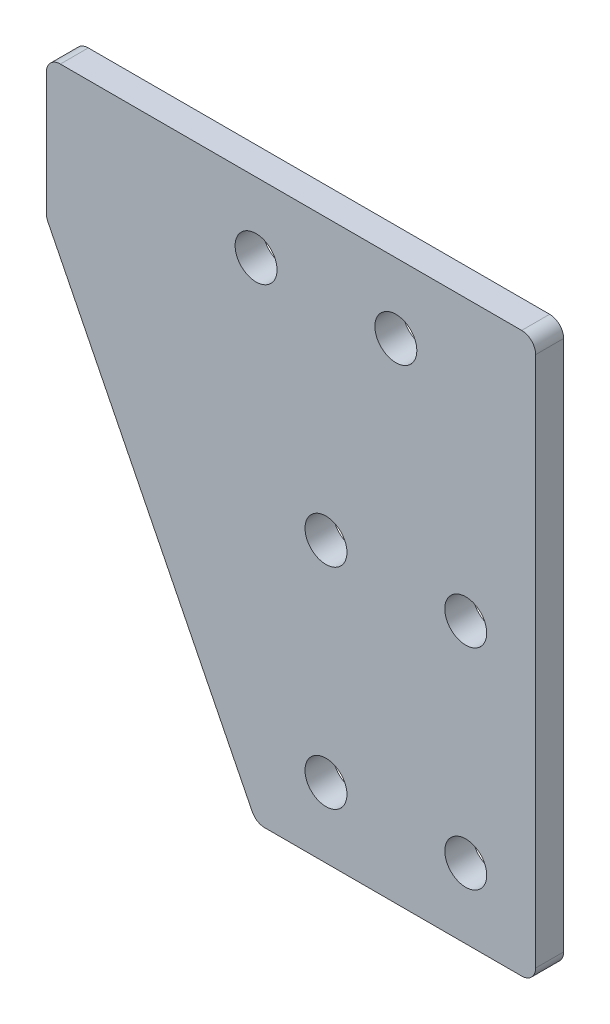
ISO-10303-21;
HEADER;
FILE_DESCRIPTION(('STEP AP214'),'2;1');
FILE_NAME('part.step','',(''),(''),'','','');
FILE_SCHEMA(('AUTOMOTIVE_DESIGN { 1 0 10303 214 1 1 1 1 }'));
ENDSEC;
DATA;
#1=APPLICATION_CONTEXT('core data for automotive mechanical design processes');
#2=APPLICATION_PROTOCOL_DEFINITION('international standard','automotive_design',2000,#1);
#3=PRODUCT_CONTEXT('',#1,'mechanical');
#4=PRODUCT('Part','Part','',(#3));
#5=PRODUCT_RELATED_PRODUCT_CATEGORY('part','',(#4));
#6=PRODUCT_DEFINITION_FORMATION('','',#4);
#7=PRODUCT_DEFINITION_CONTEXT('part definition',#1,'design');
#8=PRODUCT_DEFINITION('design','',#6,#7);
#9=PRODUCT_DEFINITION_SHAPE('','',#8);
#10=(LENGTH_UNIT() NAMED_UNIT(*) SI_UNIT(.MILLI.,.METRE.));
#11=(NAMED_UNIT(*) PLANE_ANGLE_UNIT() SI_UNIT($,.RADIAN.));
#12=(NAMED_UNIT(*) SI_UNIT($,.STERADIAN.) SOLID_ANGLE_UNIT());
#13=UNCERTAINTY_MEASURE_WITH_UNIT(LENGTH_MEASURE(1.E-05),#10,'distance_accuracy_value','');
#14=(GEOMETRIC_REPRESENTATION_CONTEXT(3) GLOBAL_UNCERTAINTY_ASSIGNED_CONTEXT((#13)) GLOBAL_UNIT_ASSIGNED_CONTEXT((#10,
#11,#12)) REPRESENTATION_CONTEXT('',''));
#15=CARTESIAN_POINT('',(0.,0.,0.));
#16=DIRECTION('',(0.,0.,1.));
#17=DIRECTION('',(1.,0.,0.));
#18=AXIS2_PLACEMENT_3D('',#15,#16,#17);
#19=CARTESIAN_POINT('',(0.,0.,2.));
#20=DIRECTION('',(0.,0.,-1.));
#21=DIRECTION('',(-1.,0.,0.));
#22=AXIS2_PLACEMENT_3D('',#19,#20,#21);
#23=PLANE('',#22);
#24=DIRECTION('',(1.,0.,0.));
#25=VECTOR('',#24,1.);
#26=CARTESIAN_POINT('',(5.,-35.,2.));
#27=LINE('',#26,#25);
#28=CARTESIAN_POINT('',(-14.3819660112501,-35.,2.));
#29=VERTEX_POINT('',#28);
#30=CARTESIAN_POINT('',(4.,-35.,2.));
#31=VERTEX_POINT('',#30);
#32=EDGE_CURVE('E201',#29,#31,#27,.T.);
#33=ORIENTED_EDGE('',*,*,#32,.T.);
#34=CARTESIAN_POINT('',(4.,-34.,2.));
#35=DIRECTION('',(0.,0.,-1.));
#36=DIRECTION('',(-1.,0.,0.));
#37=AXIS2_PLACEMENT_3D('',#34,#35,#36);
#38=CIRCLE('',#37,1.);
#39=CARTESIAN_POINT('',(5.,-34.,2.));
#40=VERTEX_POINT('',#39);
#41=EDGE_CURVE('E173',#31,#40,#38,.F.);
#42=ORIENTED_EDGE('',*,*,#41,.T.);
#43=DIRECTION('',(0.,1.,0.));
#44=VECTOR('',#43,1.);
#45=CARTESIAN_POINT('',(4.99999999999999,5.,2.));
#46=LINE('',#45,#44);
#47=CARTESIAN_POINT('',(4.99999999999999,4.,2.));
#48=VERTEX_POINT('',#47);
#49=EDGE_CURVE('E136',#40,#48,#46,.T.);
#50=ORIENTED_EDGE('',*,*,#49,.T.);
#51=CARTESIAN_POINT('',(3.99999999999999,4.,2.));
#52=DIRECTION('',(0.,0.,-1.));
#53=DIRECTION('',(-1.,0.,0.));
#54=AXIS2_PLACEMENT_3D('',#51,#52,#53);
#55=CIRCLE('',#54,1.);
#56=CARTESIAN_POINT('',(3.99999999999999,5.,2.));
#57=VERTEX_POINT('',#56);
#58=EDGE_CURVE('E169',#48,#57,#55,.F.);
#59=ORIENTED_EDGE('',*,*,#58,.T.);
#60=DIRECTION('',(-1.,0.,0.));
#61=VECTOR('',#60,1.);
#62=CARTESIAN_POINT('',(-30.,5.,2.));
#63=LINE('',#62,#61);
#64=CARTESIAN_POINT('',(-29.,5.,2.));
#65=VERTEX_POINT('',#64);
#66=EDGE_CURVE('E210',#57,#65,#63,.T.);
#67=ORIENTED_EDGE('',*,*,#66,.T.);
#68=CARTESIAN_POINT('',(-29.,4.,2.));
#69=DIRECTION('',(0.,0.,-1.));
#70=DIRECTION('',(-1.,0.,0.));
#71=AXIS2_PLACEMENT_3D('',#68,#69,#70);
#72=CIRCLE('',#71,1.);
#73=CARTESIAN_POINT('',(-30.,4.,2.));
#74=VERTEX_POINT('',#73);
#75=EDGE_CURVE('E59',#65,#74,#72,.F.);
#76=ORIENTED_EDGE('',*,*,#75,.T.);
#77=DIRECTION('',(0.,-1.,0.));
#78=VECTOR('',#77,1.);
#79=CARTESIAN_POINT('',(-30.,-5.,2.));
#80=LINE('',#79,#78);
#81=CARTESIAN_POINT('',(-30.,-4.76393202250021,2.));
#82=VERTEX_POINT('',#81);
#83=EDGE_CURVE('E156',#74,#82,#80,.T.);
#84=ORIENTED_EDGE('',*,*,#83,.T.);
#85=CARTESIAN_POINT('',(-29.,-4.76393202250021,2.));
#86=DIRECTION('',(0.,0.,-1.));
#87=DIRECTION('',(-1.,0.,0.));
#88=AXIS2_PLACEMENT_3D('',#85,#86,#87);
#89=CIRCLE('',#88,1.);
#90=CARTESIAN_POINT('',(-29.8944271909999,-5.21114561800016,2.));
#91=VERTEX_POINT('',#90);
#92=EDGE_CURVE('E167',#82,#91,#89,.F.);
#93=ORIENTED_EDGE('',*,*,#92,.T.);
#94=DIRECTION('',(0.447213595499958,-0.894427190999916,0.));
#95=VECTOR('',#94,1.);
#96=CARTESIAN_POINT('',(-15.,-35.,2.));
#97=LINE('',#96,#95);
#98=CARTESIAN_POINT('',(-15.27639320225,-34.4472135955,2.));
#99=VERTEX_POINT('',#98);
#100=EDGE_CURVE('E155',#91,#99,#97,.T.);
#101=ORIENTED_EDGE('',*,*,#100,.T.);
#102=CARTESIAN_POINT('',(-14.3819660112501,-34.,2.));
#103=DIRECTION('',(0.,0.,-1.));
#104=DIRECTION('',(-1.,0.,0.));
#105=AXIS2_PLACEMENT_3D('',#102,#103,#104);
#106=CIRCLE('',#105,1.);
#107=EDGE_CURVE('E171',#99,#29,#106,.F.);
#108=ORIENTED_EDGE('',*,*,#107,.T.);
#109=EDGE_LOOP('',(#33,#42,#50,#59,#67,#76,#84,#93,#101,#108));
#110=FACE_BOUND('',#109,.T.);
#111=CARTESIAN_POINT('',(-15.,0.,2.));
#112=DIRECTION('',(0.,0.,1.));
#113=DIRECTION('',(1.,0.,0.));
#114=AXIS2_PLACEMENT_3D('',#111,#112,#113);
#115=CIRCLE('',#114,1.50000000000003);
#116=CARTESIAN_POINT('',(-13.5,0.,2.));
#117=VERTEX_POINT('',#116);
#118=EDGE_CURVE('E212',#117,#117,#115,.T.);
#119=ORIENTED_EDGE('',*,*,#118,.F.);
#120=EDGE_LOOP('',(#119));
#121=FACE_BOUND('',#120,.T.);
#122=CARTESIAN_POINT('',(-5.00000000000001,0.,2.));
#123=DIRECTION('',(0.,0.,1.));
#124=DIRECTION('',(1.,0.,0.));
#125=AXIS2_PLACEMENT_3D('',#122,#123,#124);
#126=CIRCLE('',#125,1.50000000000003);
#127=CARTESIAN_POINT('',(-3.49999999999999,0.,2.));
#128=VERTEX_POINT('',#127);
#129=EDGE_CURVE('E217',#128,#128,#126,.T.);
#130=ORIENTED_EDGE('',*,*,#129,.F.);
#131=EDGE_LOOP('',(#130));
#132=FACE_BOUND('',#131,.T.);
#133=CARTESIAN_POINT('',(-10.,-15.,2.));
#134=DIRECTION('',(0.,0.,1.));
#135=DIRECTION('',(1.,0.,0.));
#136=AXIS2_PLACEMENT_3D('',#133,#134,#135);
#137=CIRCLE('',#136,1.50000000000003);
#138=CARTESIAN_POINT('',(-8.49999999999998,-15.,2.));
#139=VERTEX_POINT('',#138);
#140=EDGE_CURVE('E222',#139,#139,#137,.T.);
#141=ORIENTED_EDGE('',*,*,#140,.F.);
#142=EDGE_LOOP('',(#141));
#143=FACE_BOUND('',#142,.T.);
#144=CARTESIAN_POINT('',(-10.,-30.,2.));
#145=DIRECTION('',(0.,0.,1.));
#146=DIRECTION('',(1.,0.,0.));
#147=AXIS2_PLACEMENT_3D('',#144,#145,#146);
#148=CIRCLE('',#147,1.50000000000003);
#149=CARTESIAN_POINT('',(-8.49999999999998,-30.,2.));
#150=VERTEX_POINT('',#149);
#151=EDGE_CURVE('E228',#150,#150,#148,.T.);
#152=ORIENTED_EDGE('',*,*,#151,.F.);
#153=EDGE_LOOP('',(#152));
#154=FACE_BOUND('',#153,.T.);
#155=CARTESIAN_POINT('',(0.,-30.,2.));
#156=DIRECTION('',(0.,0.,1.));
#157=DIRECTION('',(1.,0.,0.));
#158=AXIS2_PLACEMENT_3D('',#155,#156,#157);
#159=CIRCLE('',#158,1.50000000000003);
#160=CARTESIAN_POINT('',(1.50000000000003,-30.,2.));
#161=VERTEX_POINT('',#160);
#162=EDGE_CURVE('E234',#161,#161,#159,.T.);
#163=ORIENTED_EDGE('',*,*,#162,.F.);
#164=EDGE_LOOP('',(#163));
#165=FACE_BOUND('',#164,.T.);
#166=CARTESIAN_POINT('',(0.,-15.,2.));
#167=DIRECTION('',(0.,0.,1.));
#168=DIRECTION('',(1.,0.,0.));
#169=AXIS2_PLACEMENT_3D('',#166,#167,#168);
#170=CIRCLE('',#169,1.50000000000003);
#171=CARTESIAN_POINT('',(1.50000000000002,-15.,2.));
#172=VERTEX_POINT('',#171);
#173=EDGE_CURVE('E240',#172,#172,#170,.T.);
#174=ORIENTED_EDGE('',*,*,#173,.F.);
#175=EDGE_LOOP('',(#174));
#176=FACE_BOUND('',#175,.T.);
#177=ADVANCED_FACE('F39',(#110,#121,#132,#143,#154,#165,#176),#23,.F.);
#178=CARTESIAN_POINT('',(0.,0.,0.));
#179=DIRECTION('',(0.,0.,-1.));
#180=DIRECTION('',(-1.,0.,0.));
#181=AXIS2_PLACEMENT_3D('',#178,#179,#180);
#182=PLANE('',#181);
#183=CARTESIAN_POINT('',(0.,-30.,0.));
#184=DIRECTION('',(0.,0.,1.));
#185=DIRECTION('',(1.,0.,0.));
#186=AXIS2_PLACEMENT_3D('',#183,#184,#185);
#187=CIRCLE('',#186,1.50000000000003);
#188=CARTESIAN_POINT('',(1.50000000000003,-30.,0.));
#189=VERTEX_POINT('',#188);
#190=EDGE_CURVE('E237',#189,#189,#187,.T.);
#191=ORIENTED_EDGE('',*,*,#190,.T.);
#192=EDGE_LOOP('',(#191));
#193=FACE_BOUND('',#192,.T.);
#194=CARTESIAN_POINT('',(-10.,-15.,0.));
#195=DIRECTION('',(0.,0.,1.));
#196=DIRECTION('',(1.,0.,0.));
#197=AXIS2_PLACEMENT_3D('',#194,#195,#196);
#198=CIRCLE('',#197,1.50000000000003);
#199=CARTESIAN_POINT('',(-8.49999999999998,-15.,0.));
#200=VERTEX_POINT('',#199);
#201=EDGE_CURVE('E225',#200,#200,#198,.T.);
#202=ORIENTED_EDGE('',*,*,#201,.T.);
#203=EDGE_LOOP('',(#202));
#204=FACE_BOUND('',#203,.T.);
#205=CARTESIAN_POINT('',(-15.,0.,0.));
#206=DIRECTION('',(0.,0.,1.));
#207=DIRECTION('',(1.,0.,0.));
#208=AXIS2_PLACEMENT_3D('',#205,#206,#207);
#209=CIRCLE('',#208,1.50000000000003);
#210=CARTESIAN_POINT('',(-13.5,0.,0.));
#211=VERTEX_POINT('',#210);
#212=EDGE_CURVE('E206',#211,#211,#209,.T.);
#213=ORIENTED_EDGE('',*,*,#212,.T.);
#214=EDGE_LOOP('',(#213));
#215=FACE_BOUND('',#214,.T.);
#216=DIRECTION('',(0.,1.,0.));
#217=VECTOR('',#216,1.);
#218=CARTESIAN_POINT('',(4.99999999999999,5.,0.));
#219=LINE('',#218,#217);
#220=CARTESIAN_POINT('',(5.,-34.,0.));
#221=VERTEX_POINT('',#220);
#222=CARTESIAN_POINT('',(4.99999999999999,4.,0.));
#223=VERTEX_POINT('',#222);
#224=EDGE_CURVE('E133',#221,#223,#219,.T.);
#225=ORIENTED_EDGE('',*,*,#224,.F.);
#226=CARTESIAN_POINT('',(4.,-34.,0.));
#227=DIRECTION('',(0.,0.,-1.));
#228=DIRECTION('',(-1.,0.,0.));
#229=AXIS2_PLACEMENT_3D('',#226,#227,#228);
#230=CIRCLE('',#229,1.);
#231=CARTESIAN_POINT('',(4.,-35.,0.));
#232=VERTEX_POINT('',#231);
#233=EDGE_CURVE('E116',#221,#232,#230,.T.);
#234=ORIENTED_EDGE('',*,*,#233,.T.);
#235=DIRECTION('',(1.,0.,0.));
#236=VECTOR('',#235,1.);
#237=CARTESIAN_POINT('',(5.,-35.,0.));
#238=LINE('',#237,#236);
#239=CARTESIAN_POINT('',(-14.3819660112501,-35.,0.));
#240=VERTEX_POINT('',#239);
#241=EDGE_CURVE('E145',#240,#232,#238,.T.);
#242=ORIENTED_EDGE('',*,*,#241,.F.);
#243=CARTESIAN_POINT('',(-14.3819660112501,-34.,0.));
#244=DIRECTION('',(0.,0.,-1.));
#245=DIRECTION('',(-1.,0.,0.));
#246=AXIS2_PLACEMENT_3D('',#243,#244,#245);
#247=CIRCLE('',#246,1.);
#248=CARTESIAN_POINT('',(-15.27639320225,-34.4472135955,0.));
#249=VERTEX_POINT('',#248);
#250=EDGE_CURVE('E127',#240,#249,#247,.T.);
#251=ORIENTED_EDGE('',*,*,#250,.T.);
#252=DIRECTION('',(0.447213595499958,-0.894427190999916,0.));
#253=VECTOR('',#252,1.);
#254=CARTESIAN_POINT('',(-15.,-35.,0.));
#255=LINE('',#254,#253);
#256=CARTESIAN_POINT('',(-29.8944271909999,-5.21114561800016,0.));
#257=VERTEX_POINT('',#256);
#258=EDGE_CURVE('E150',#257,#249,#255,.T.);
#259=ORIENTED_EDGE('',*,*,#258,.F.);
#260=CARTESIAN_POINT('',(-29.,-4.76393202250021,0.));
#261=DIRECTION('',(0.,0.,-1.));
#262=DIRECTION('',(-1.,0.,0.));
#263=AXIS2_PLACEMENT_3D('',#260,#261,#262);
#264=CIRCLE('',#263,1.);
#265=CARTESIAN_POINT('',(-30.,-4.76393202250021,0.));
#266=VERTEX_POINT('',#265);
#267=EDGE_CURVE('E159',#257,#266,#264,.T.);
#268=ORIENTED_EDGE('',*,*,#267,.T.);
#269=DIRECTION('',(0.,-1.,0.));
#270=VECTOR('',#269,1.);
#271=CARTESIAN_POINT('',(-30.,-5.,0.));
#272=LINE('',#271,#270);
#273=CARTESIAN_POINT('',(-30.,4.,0.));
#274=VERTEX_POINT('',#273);
#275=EDGE_CURVE('E148',#274,#266,#272,.T.);
#276=ORIENTED_EDGE('',*,*,#275,.F.);
#277=CARTESIAN_POINT('',(-29.,4.,0.));
#278=DIRECTION('',(0.,0.,-1.));
#279=DIRECTION('',(-1.,0.,0.));
#280=AXIS2_PLACEMENT_3D('',#277,#278,#279);
#281=CIRCLE('',#280,1.);
#282=CARTESIAN_POINT('',(-29.,5.,0.));
#283=VERTEX_POINT('',#282);
#284=EDGE_CURVE('E137',#274,#283,#281,.T.);
#285=ORIENTED_EDGE('',*,*,#284,.T.);
#286=DIRECTION('',(-1.,0.,0.));
#287=VECTOR('',#286,1.);
#288=CARTESIAN_POINT('',(-30.,5.,0.));
#289=LINE('',#288,#287);
#290=CARTESIAN_POINT('',(3.99999999999999,5.,0.));
#291=VERTEX_POINT('',#290);
#292=EDGE_CURVE('E144',#291,#283,#289,.T.);
#293=ORIENTED_EDGE('',*,*,#292,.F.);
#294=CARTESIAN_POINT('',(3.99999999999999,4.,0.));
#295=DIRECTION('',(0.,0.,-1.));
#296=DIRECTION('',(-1.,0.,0.));
#297=AXIS2_PLACEMENT_3D('',#294,#295,#296);
#298=CIRCLE('',#297,1.);
#299=EDGE_CURVE('E143',#291,#223,#298,.T.);
#300=ORIENTED_EDGE('',*,*,#299,.T.);
#301=EDGE_LOOP('',(#225,#234,#242,#251,#259,#268,#276,#285,#293,#300));
#302=FACE_BOUND('',#301,.T.);
#303=CARTESIAN_POINT('',(-5.00000000000001,0.,0.));
#304=DIRECTION('',(0.,0.,1.));
#305=DIRECTION('',(1.,0.,0.));
#306=AXIS2_PLACEMENT_3D('',#303,#304,#305);
#307=CIRCLE('',#306,1.50000000000003);
#308=CARTESIAN_POINT('',(-3.49999999999999,0.,0.));
#309=VERTEX_POINT('',#308);
#310=EDGE_CURVE('E219',#309,#309,#307,.T.);
#311=ORIENTED_EDGE('',*,*,#310,.T.);
#312=EDGE_LOOP('',(#311));
#313=FACE_BOUND('',#312,.T.);
#314=CARTESIAN_POINT('',(-10.,-30.,0.));
#315=DIRECTION('',(0.,0.,1.));
#316=DIRECTION('',(1.,0.,0.));
#317=AXIS2_PLACEMENT_3D('',#314,#315,#316);
#318=CIRCLE('',#317,1.50000000000003);
#319=CARTESIAN_POINT('',(-8.49999999999998,-30.,0.));
#320=VERTEX_POINT('',#319);
#321=EDGE_CURVE('E231',#320,#320,#318,.T.);
#322=ORIENTED_EDGE('',*,*,#321,.T.);
#323=EDGE_LOOP('',(#322));
#324=FACE_BOUND('',#323,.T.);
#325=CARTESIAN_POINT('',(0.,-15.,0.));
#326=DIRECTION('',(0.,0.,1.));
#327=DIRECTION('',(1.,0.,0.));
#328=AXIS2_PLACEMENT_3D('',#325,#326,#327);
#329=CIRCLE('',#328,1.50000000000003);
#330=CARTESIAN_POINT('',(1.50000000000002,-15.,0.));
#331=VERTEX_POINT('',#330);
#332=EDGE_CURVE('E243',#331,#331,#329,.T.);
#333=ORIENTED_EDGE('',*,*,#332,.T.);
#334=EDGE_LOOP('',(#333));
#335=FACE_BOUND('',#334,.T.);
#336=ADVANCED_FACE('F140',(#193,#204,#215,#302,#313,#324,#335),#182,.T.);
#337=CARTESIAN_POINT('',(-15.,-35.,2.));
#338=DIRECTION('',(0.894427190999916,0.447213595499958,0.));
#339=DIRECTION('',(-0.447213595499958,0.894427190999916,0.));
#340=AXIS2_PLACEMENT_3D('',#337,#338,#339);
#341=PLANE('',#340);
#342=ORIENTED_EDGE('',*,*,#258,.T.);
#343=DIRECTION('',(0.,0.,-1.));
#344=VECTOR('',#343,1.);
#345=CARTESIAN_POINT('',(-15.27639320225,-34.4472135955,2.));
#346=LINE('',#345,#344);
#347=EDGE_CURVE('E178',#249,#99,#346,.F.);
#348=ORIENTED_EDGE('',*,*,#347,.T.);
#349=ORIENTED_EDGE('',*,*,#100,.F.);
#350=DIRECTION('',(0.,0.,-1.));
#351=VECTOR('',#350,1.);
#352=CARTESIAN_POINT('',(-29.8944271909999,-5.21114561800017,2.));
#353=LINE('',#352,#351);
#354=EDGE_CURVE('E175',#91,#257,#353,.T.);
#355=ORIENTED_EDGE('',*,*,#354,.T.);
#356=EDGE_LOOP('',(#342,#348,#349,#355));
#357=FACE_BOUND('',#356,.T.);
#358=ADVANCED_FACE('F197',(#357),#341,.F.);
#359=CARTESIAN_POINT('',(5.,-35.,2.));
#360=DIRECTION('',(0.,1.,0.));
#361=DIRECTION('',(0.,0.,1.));
#362=AXIS2_PLACEMENT_3D('',#359,#360,#361);
#363=PLANE('',#362);
#364=ORIENTED_EDGE('',*,*,#241,.T.);
#365=DIRECTION('',(0.,0.,-1.));
#366=VECTOR('',#365,1.);
#367=CARTESIAN_POINT('',(4.,-35.,2.));
#368=LINE('',#367,#366);
#369=EDGE_CURVE('E121',#232,#31,#368,.F.);
#370=ORIENTED_EDGE('',*,*,#369,.T.);
#371=ORIENTED_EDGE('',*,*,#32,.F.);
#372=DIRECTION('',(0.,0.,-1.));
#373=VECTOR('',#372,1.);
#374=CARTESIAN_POINT('',(-14.3819660112501,-35.,2.));
#375=LINE('',#374,#373);
#376=EDGE_CURVE('E126',#29,#240,#375,.T.);
#377=ORIENTED_EDGE('',*,*,#376,.T.);
#378=EDGE_LOOP('',(#364,#370,#371,#377));
#379=FACE_BOUND('',#378,.T.);
#380=ADVANCED_FACE('F272',(#379),#363,.F.);
#381=CARTESIAN_POINT('',(4.99999999999999,5.,2.));
#382=DIRECTION('',(-1.,0.,0.));
#383=DIRECTION('',(0.,-1.,0.));
#384=AXIS2_PLACEMENT_3D('',#381,#382,#383);
#385=PLANE('',#384);
#386=ORIENTED_EDGE('',*,*,#49,.F.);
#387=DIRECTION('',(0.,0.,-1.));
#388=VECTOR('',#387,1.);
#389=CARTESIAN_POINT('',(5.,-34.,2.));
#390=LINE('',#389,#388);
#391=EDGE_CURVE('E120',#40,#221,#390,.T.);
#392=ORIENTED_EDGE('',*,*,#391,.T.);
#393=ORIENTED_EDGE('',*,*,#224,.T.);
#394=DIRECTION('',(0.,0.,-1.));
#395=VECTOR('',#394,1.);
#396=CARTESIAN_POINT('',(4.99999999999999,4.,2.));
#397=LINE('',#396,#395);
#398=EDGE_CURVE('E138',#223,#48,#397,.F.);
#399=ORIENTED_EDGE('',*,*,#398,.T.);
#400=EDGE_LOOP('',(#386,#392,#393,#399));
#401=FACE_BOUND('',#400,.T.);
#402=ADVANCED_FACE('F132',(#401),#385,.F.);
#403=CARTESIAN_POINT('',(-30.,5.,2.));
#404=DIRECTION('',(0.,-1.,0.));
#405=DIRECTION('',(0.,0.,-1.));
#406=AXIS2_PLACEMENT_3D('',#403,#404,#405);
#407=PLANE('',#406);
#408=ORIENTED_EDGE('',*,*,#66,.F.);
#409=DIRECTION('',(0.,0.,-1.));
#410=VECTOR('',#409,1.);
#411=CARTESIAN_POINT('',(3.99999999999999,5.,2.));
#412=LINE('',#411,#410);
#413=EDGE_CURVE('E182',#57,#291,#412,.T.);
#414=ORIENTED_EDGE('',*,*,#413,.T.);
#415=ORIENTED_EDGE('',*,*,#292,.T.);
#416=DIRECTION('',(0.,0.,-1.));
#417=VECTOR('',#416,1.);
#418=CARTESIAN_POINT('',(-29.,5.,2.));
#419=LINE('',#418,#417);
#420=EDGE_CURVE('E180',#283,#65,#419,.F.);
#421=ORIENTED_EDGE('',*,*,#420,.T.);
#422=EDGE_LOOP('',(#408,#414,#415,#421));
#423=FACE_BOUND('',#422,.T.);
#424=ADVANCED_FACE('F266',(#423),#407,.F.);
#425=CARTESIAN_POINT('',(-30.,-5.,2.));
#426=DIRECTION('',(1.,0.,0.));
#427=DIRECTION('',(0.,0.,-1.));
#428=AXIS2_PLACEMENT_3D('',#425,#426,#427);
#429=PLANE('',#428);
#430=ORIENTED_EDGE('',*,*,#275,.T.);
#431=DIRECTION('',(0.,0.,-1.));
#432=VECTOR('',#431,1.);
#433=CARTESIAN_POINT('',(-30.,-4.76393202250021,2.));
#434=LINE('',#433,#432);
#435=EDGE_CURVE('E11',#266,#82,#434,.F.);
#436=ORIENTED_EDGE('',*,*,#435,.T.);
#437=ORIENTED_EDGE('',*,*,#83,.F.);
#438=DIRECTION('',(0.,0.,-1.));
#439=VECTOR('',#438,1.);
#440=CARTESIAN_POINT('',(-30.,4.,2.));
#441=LINE('',#440,#439);
#442=EDGE_CURVE('E47',#74,#274,#441,.T.);
#443=ORIENTED_EDGE('',*,*,#442,.T.);
#444=EDGE_LOOP('',(#430,#436,#437,#443));
#445=FACE_BOUND('',#444,.T.);
#446=ADVANCED_FACE('F187',(#445),#429,.F.);
#447=CARTESIAN_POINT('',(-15.,0.,2.));
#448=DIRECTION('',(0.,0.,-1.));
#449=DIRECTION('',(-1.,0.,0.));
#450=AXIS2_PLACEMENT_3D('',#447,#448,#449);
#451=CYLINDRICAL_SURFACE('',#450,1.50000000000003);
#452=ORIENTED_EDGE('',*,*,#118,.T.);
#453=EDGE_LOOP('',(#452));
#454=FACE_BOUND('',#453,.T.);
#455=ORIENTED_EDGE('',*,*,#212,.F.);
#456=EDGE_LOOP('',(#455));
#457=FACE_BOUND('',#456,.T.);
#458=ADVANCED_FACE('F261',(#454,#457),#451,.F.);
#459=CARTESIAN_POINT('',(-5.00000000000001,0.,2.));
#460=DIRECTION('',(0.,0.,-1.));
#461=DIRECTION('',(-1.,0.,0.));
#462=AXIS2_PLACEMENT_3D('',#459,#460,#461);
#463=CYLINDRICAL_SURFACE('',#462,1.50000000000003);
#464=ORIENTED_EDGE('',*,*,#129,.T.);
#465=EDGE_LOOP('',(#464));
#466=FACE_BOUND('',#465,.T.);
#467=ORIENTED_EDGE('',*,*,#310,.F.);
#468=EDGE_LOOP('',(#467));
#469=FACE_BOUND('',#468,.T.);
#470=ADVANCED_FACE('F416',(#466,#469),#463,.F.);
#471=CARTESIAN_POINT('',(-10.,-15.,2.));
#472=DIRECTION('',(0.,0.,-1.));
#473=DIRECTION('',(-1.,0.,0.));
#474=AXIS2_PLACEMENT_3D('',#471,#472,#473);
#475=CYLINDRICAL_SURFACE('',#474,1.50000000000003);
#476=ORIENTED_EDGE('',*,*,#140,.T.);
#477=EDGE_LOOP('',(#476));
#478=FACE_BOUND('',#477,.T.);
#479=ORIENTED_EDGE('',*,*,#201,.F.);
#480=EDGE_LOOP('',(#479));
#481=FACE_BOUND('',#480,.T.);
#482=ADVANCED_FACE('F405',(#478,#481),#475,.F.);
#483=CARTESIAN_POINT('',(-10.,-30.,2.));
#484=DIRECTION('',(0.,0.,-1.));
#485=DIRECTION('',(-1.,0.,0.));
#486=AXIS2_PLACEMENT_3D('',#483,#484,#485);
#487=CYLINDRICAL_SURFACE('',#486,1.50000000000003);
#488=ORIENTED_EDGE('',*,*,#151,.T.);
#489=EDGE_LOOP('',(#488));
#490=FACE_BOUND('',#489,.T.);
#491=ORIENTED_EDGE('',*,*,#321,.F.);
#492=EDGE_LOOP('',(#491));
#493=FACE_BOUND('',#492,.T.);
#494=ADVANCED_FACE('F394',(#490,#493),#487,.F.);
#495=CARTESIAN_POINT('',(0.,-30.,2.));
#496=DIRECTION('',(0.,0.,-1.));
#497=DIRECTION('',(-1.,0.,0.));
#498=AXIS2_PLACEMENT_3D('',#495,#496,#497);
#499=CYLINDRICAL_SURFACE('',#498,1.50000000000003);
#500=ORIENTED_EDGE('',*,*,#162,.T.);
#501=EDGE_LOOP('',(#500));
#502=FACE_BOUND('',#501,.T.);
#503=ORIENTED_EDGE('',*,*,#190,.F.);
#504=EDGE_LOOP('',(#503));
#505=FACE_BOUND('',#504,.T.);
#506=ADVANCED_FACE('F384',(#502,#505),#499,.F.);
#507=CARTESIAN_POINT('',(0.,-15.,2.));
#508=DIRECTION('',(0.,0.,-1.));
#509=DIRECTION('',(-1.,0.,0.));
#510=AXIS2_PLACEMENT_3D('',#507,#508,#509);
#511=CYLINDRICAL_SURFACE('',#510,1.50000000000003);
#512=ORIENTED_EDGE('',*,*,#173,.T.);
#513=EDGE_LOOP('',(#512));
#514=FACE_BOUND('',#513,.T.);
#515=ORIENTED_EDGE('',*,*,#332,.F.);
#516=EDGE_LOOP('',(#515));
#517=FACE_BOUND('',#516,.T.);
#518=ADVANCED_FACE('F249',(#514,#517),#511,.F.);
#519=CARTESIAN_POINT('',(4.,-34.,2.));
#520=DIRECTION('',(0.,0.,-1.));
#521=DIRECTION('',(-1.,0.,0.));
#522=AXIS2_PLACEMENT_3D('',#519,#520,#521);
#523=CYLINDRICAL_SURFACE('',#522,1.);
#524=ORIENTED_EDGE('',*,*,#41,.F.);
#525=ORIENTED_EDGE('',*,*,#369,.F.);
#526=ORIENTED_EDGE('',*,*,#233,.F.);
#527=ORIENTED_EDGE('',*,*,#391,.F.);
#528=EDGE_LOOP('',(#524,#525,#526,#527));
#529=FACE_BOUND('',#528,.T.);
#530=ADVANCED_FACE('F119',(#529),#523,.T.);
#531=CARTESIAN_POINT('',(-14.3819660112501,-34.,2.));
#532=DIRECTION('',(0.,0.,-1.));
#533=DIRECTION('',(-1.,0.,0.));
#534=AXIS2_PLACEMENT_3D('',#531,#532,#533);
#535=CYLINDRICAL_SURFACE('',#534,1.);
#536=ORIENTED_EDGE('',*,*,#107,.F.);
#537=ORIENTED_EDGE('',*,*,#347,.F.);
#538=ORIENTED_EDGE('',*,*,#250,.F.);
#539=ORIENTED_EDGE('',*,*,#376,.F.);
#540=EDGE_LOOP('',(#536,#537,#538,#539));
#541=FACE_BOUND('',#540,.T.);
#542=ADVANCED_FACE('F280',(#541),#535,.T.);
#543=CARTESIAN_POINT('',(3.99999999999999,4.,2.));
#544=DIRECTION('',(0.,0.,-1.));
#545=DIRECTION('',(-1.,0.,0.));
#546=AXIS2_PLACEMENT_3D('',#543,#544,#545);
#547=CYLINDRICAL_SURFACE('',#546,1.);
#548=ORIENTED_EDGE('',*,*,#58,.F.);
#549=ORIENTED_EDGE('',*,*,#398,.F.);
#550=ORIENTED_EDGE('',*,*,#299,.F.);
#551=ORIENTED_EDGE('',*,*,#413,.F.);
#552=EDGE_LOOP('',(#548,#549,#550,#551));
#553=FACE_BOUND('',#552,.T.);
#554=ADVANCED_FACE('F283',(#553),#547,.T.);
#555=CARTESIAN_POINT('',(-29.,-4.76393202250021,2.));
#556=DIRECTION('',(0.,0.,-1.));
#557=DIRECTION('',(-1.,0.,0.));
#558=AXIS2_PLACEMENT_3D('',#555,#556,#557);
#559=CYLINDRICAL_SURFACE('',#558,1.);
#560=ORIENTED_EDGE('',*,*,#92,.F.);
#561=ORIENTED_EDGE('',*,*,#435,.F.);
#562=ORIENTED_EDGE('',*,*,#267,.F.);
#563=ORIENTED_EDGE('',*,*,#354,.F.);
#564=EDGE_LOOP('',(#560,#561,#562,#563));
#565=FACE_BOUND('',#564,.T.);
#566=ADVANCED_FACE('F194',(#565),#559,.T.);
#567=CARTESIAN_POINT('',(-29.,4.,2.));
#568=DIRECTION('',(0.,0.,-1.));
#569=DIRECTION('',(-1.,0.,0.));
#570=AXIS2_PLACEMENT_3D('',#567,#568,#569);
#571=CYLINDRICAL_SURFACE('',#570,1.);
#572=ORIENTED_EDGE('',*,*,#75,.F.);
#573=ORIENTED_EDGE('',*,*,#420,.F.);
#574=ORIENTED_EDGE('',*,*,#284,.F.);
#575=ORIENTED_EDGE('',*,*,#442,.F.);
#576=EDGE_LOOP('',(#572,#573,#574,#575));
#577=FACE_BOUND('',#576,.T.);
#578=ADVANCED_FACE('F41',(#577),#571,.T.);
#579=CLOSED_SHELL('',(#177,#336,#358,#380,#402,#424,#446,#458,#470,#482,#494,#506,#518,#530,
#542,#554,#566,#578));
#580=MANIFOLD_SOLID_BREP('B2',#579);
#581=ADVANCED_BREP_SHAPE_REPRESENTATION('',(#18,#580),#14);
#582=SHAPE_DEFINITION_REPRESENTATION(#9,#581);
ENDSEC;
END-ISO-10303-21;
